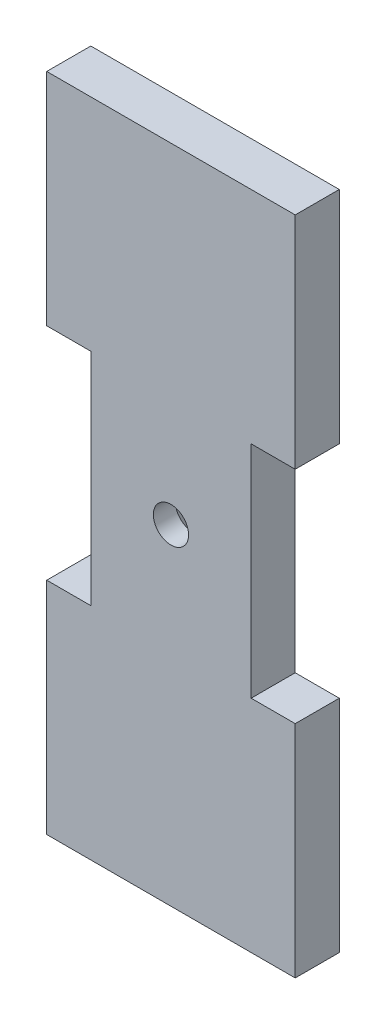
ISO-10303-21;
HEADER;
FILE_DESCRIPTION(('STEP AP214'),'2;1');
FILE_NAME('part.step','',(''),(''),'','','');
FILE_SCHEMA(('AUTOMOTIVE_DESIGN { 1 0 10303 214 1 1 1 1 }'));
ENDSEC;
DATA;
#1=APPLICATION_CONTEXT('core data for automotive mechanical design processes');
#2=APPLICATION_PROTOCOL_DEFINITION('international standard','automotive_design',2000,#1);
#3=PRODUCT_CONTEXT('',#1,'mechanical');
#4=PRODUCT('Part','Part','',(#3));
#5=PRODUCT_RELATED_PRODUCT_CATEGORY('part','',(#4));
#6=PRODUCT_DEFINITION_FORMATION('','',#4);
#7=PRODUCT_DEFINITION_CONTEXT('part definition',#1,'design');
#8=PRODUCT_DEFINITION('design','',#6,#7);
#9=PRODUCT_DEFINITION_SHAPE('','',#8);
#10=(LENGTH_UNIT() NAMED_UNIT(*) SI_UNIT(.MILLI.,.METRE.));
#11=(NAMED_UNIT(*) PLANE_ANGLE_UNIT() SI_UNIT($,.RADIAN.));
#12=(NAMED_UNIT(*) SI_UNIT($,.STERADIAN.) SOLID_ANGLE_UNIT());
#13=UNCERTAINTY_MEASURE_WITH_UNIT(LENGTH_MEASURE(1.E-05),#10,'distance_accuracy_value','');
#14=(GEOMETRIC_REPRESENTATION_CONTEXT(3) GLOBAL_UNCERTAINTY_ASSIGNED_CONTEXT((#13)) GLOBAL_UNIT_ASSIGNED_CONTEXT((#10,
#11,#12)) REPRESENTATION_CONTEXT('',''));
#15=CARTESIAN_POINT('',(0.,0.,0.));
#16=DIRECTION('',(0.,0.,1.));
#17=DIRECTION('',(1.,0.,0.));
#18=AXIS2_PLACEMENT_3D('',#15,#16,#17);
#19=CARTESIAN_POINT('',(0.,0.,10.));
#20=DIRECTION('',(0.,0.,-1.));
#21=DIRECTION('',(-1.,0.,0.));
#22=AXIS2_PLACEMENT_3D('',#19,#20,#21);
#23=PLANE('',#22);
#24=DIRECTION('',(0.,-1.,0.));
#25=VECTOR('',#24,1.);
#26=CARTESIAN_POINT('',(0.,50.,10.));
#27=LINE('',#26,#25);
#28=CARTESIAN_POINT('',(0.,50.,10.));
#29=VERTEX_POINT('',#28);
#30=CARTESIAN_POINT('',(0.,0.,10.));
#31=VERTEX_POINT('',#30);
#32=EDGE_CURVE('E178',#29,#31,#27,.T.);
#33=ORIENTED_EDGE('',*,*,#32,.T.);
#34=DIRECTION('',(1.,0.,0.));
#35=VECTOR('',#34,1.);
#36=CARTESIAN_POINT('',(56.4,0.,10.));
#37=LINE('',#36,#35);
#38=CARTESIAN_POINT('',(56.4,0.,10.));
#39=VERTEX_POINT('',#38);
#40=EDGE_CURVE('E106',#31,#39,#37,.T.);
#41=ORIENTED_EDGE('',*,*,#40,.T.);
#42=DIRECTION('',(0.,1.,0.));
#43=VECTOR('',#42,1.);
#44=CARTESIAN_POINT('',(56.4,50.,10.));
#45=LINE('',#44,#43);
#46=CARTESIAN_POINT('',(56.4,50.,10.));
#47=VERTEX_POINT('',#46);
#48=EDGE_CURVE('E275',#39,#47,#45,.T.);
#49=ORIENTED_EDGE('',*,*,#48,.T.);
#50=DIRECTION('',(-1.,0.,0.));
#51=VECTOR('',#50,1.);
#52=CARTESIAN_POINT('',(46.4,50.,10.));
#53=LINE('',#52,#51);
#54=CARTESIAN_POINT('',(46.4,50.,10.));
#55=VERTEX_POINT('',#54);
#56=EDGE_CURVE('E277',#47,#55,#53,.T.);
#57=ORIENTED_EDGE('',*,*,#56,.T.);
#58=DIRECTION('',(0.,1.,0.));
#59=VECTOR('',#58,1.);
#60=CARTESIAN_POINT('',(46.4,100.,10.));
#61=LINE('',#60,#59);
#62=CARTESIAN_POINT('',(46.4,100.,10.));
#63=VERTEX_POINT('',#62);
#64=EDGE_CURVE('E279',#55,#63,#61,.T.);
#65=ORIENTED_EDGE('',*,*,#64,.T.);
#66=DIRECTION('',(1.,0.,0.));
#67=VECTOR('',#66,1.);
#68=CARTESIAN_POINT('',(56.4,100.,10.));
#69=LINE('',#68,#67);
#70=CARTESIAN_POINT('',(56.4,100.,10.));
#71=VERTEX_POINT('',#70);
#72=EDGE_CURVE('E285',#63,#71,#69,.T.);
#73=ORIENTED_EDGE('',*,*,#72,.T.);
#74=DIRECTION('',(0.,1.,0.));
#75=VECTOR('',#74,1.);
#76=CARTESIAN_POINT('',(56.4,150.,10.));
#77=LINE('',#76,#75);
#78=CARTESIAN_POINT('',(56.4,150.,10.));
#79=VERTEX_POINT('',#78);
#80=EDGE_CURVE('E287',#71,#79,#77,.T.);
#81=ORIENTED_EDGE('',*,*,#80,.T.);
#82=DIRECTION('',(-1.,0.,0.));
#83=VECTOR('',#82,1.);
#84=CARTESIAN_POINT('',(0.,150.,10.));
#85=LINE('',#84,#83);
#86=CARTESIAN_POINT('',(0.,150.,10.));
#87=VERTEX_POINT('',#86);
#88=EDGE_CURVE('E289',#79,#87,#85,.T.);
#89=ORIENTED_EDGE('',*,*,#88,.T.);
#90=DIRECTION('',(0.,-1.,0.));
#91=VECTOR('',#90,1.);
#92=CARTESIAN_POINT('',(0.,150.,10.));
#93=LINE('',#92,#91);
#94=CARTESIAN_POINT('',(0.,100.,10.));
#95=VERTEX_POINT('',#94);
#96=EDGE_CURVE('E137',#87,#95,#93,.T.);
#97=ORIENTED_EDGE('',*,*,#96,.T.);
#98=DIRECTION('',(1.,0.,0.));
#99=VECTOR('',#98,1.);
#100=CARTESIAN_POINT('',(0.,100.,10.));
#101=LINE('',#100,#99);
#102=CARTESIAN_POINT('',(9.99999999999997,100.,10.));
#103=VERTEX_POINT('',#102);
#104=EDGE_CURVE('E131',#95,#103,#101,.T.);
#105=ORIENTED_EDGE('',*,*,#104,.T.);
#106=DIRECTION('',(0.,-1.,0.));
#107=VECTOR('',#106,1.);
#108=CARTESIAN_POINT('',(9.99999999999997,100.,10.));
#109=LINE('',#108,#107);
#110=CARTESIAN_POINT('',(9.99999999999996,50.,10.));
#111=VERTEX_POINT('',#110);
#112=EDGE_CURVE('E135',#103,#111,#109,.T.);
#113=ORIENTED_EDGE('',*,*,#112,.T.);
#114=DIRECTION('',(-1.,0.,0.));
#115=VECTOR('',#114,1.);
#116=CARTESIAN_POINT('',(9.99999999999996,50.,10.));
#117=LINE('',#116,#115);
#118=EDGE_CURVE('E50',#111,#29,#117,.T.);
#119=ORIENTED_EDGE('',*,*,#118,.T.);
#120=EDGE_LOOP('',(#33,#41,#49,#57,#65,#73,#81,#89,#97,#105,#113,#119));
#121=FACE_BOUND('',#120,.T.);
#122=CARTESIAN_POINT('',(28.2,75.,10.));
#123=DIRECTION('',(0.,0.,1.));
#124=DIRECTION('',(1.,0.,0.));
#125=AXIS2_PLACEMENT_3D('',#122,#123,#124);
#126=CIRCLE('',#125,4.);
#127=CARTESIAN_POINT('',(32.2,75.,10.));
#128=VERTEX_POINT('',#127);
#129=EDGE_CURVE('E159',#128,#128,#126,.T.);
#130=ORIENTED_EDGE('',*,*,#129,.F.);
#131=EDGE_LOOP('',(#130));
#132=FACE_BOUND('',#131,.T.);
#133=ADVANCED_FACE('F33',(#121,#132),#23,.F.);
#134=CARTESIAN_POINT('',(0.,0.,0.));
#135=DIRECTION('',(0.,0.,-1.));
#136=DIRECTION('',(-1.,0.,0.));
#137=AXIS2_PLACEMENT_3D('',#134,#135,#136);
#138=PLANE('',#137);
#139=CARTESIAN_POINT('',(28.2,75.,0.));
#140=DIRECTION('',(0.,0.,-1.));
#141=DIRECTION('',(-1.,0.,0.));
#142=AXIS2_PLACEMENT_3D('',#139,#140,#141);
#143=CIRCLE('',#142,8.99999999999999);
#144=CARTESIAN_POINT('',(19.2,75.,0.));
#145=VERTEX_POINT('',#144);
#146=EDGE_CURVE('E42',#145,#145,#143,.F.);
#147=ORIENTED_EDGE('',*,*,#146,.T.);
#148=EDGE_LOOP('',(#147));
#149=FACE_BOUND('',#148,.T.);
#150=DIRECTION('',(0.,-1.,0.));
#151=VECTOR('',#150,1.);
#152=CARTESIAN_POINT('',(0.,50.,0.));
#153=LINE('',#152,#151);
#154=CARTESIAN_POINT('',(0.,50.,0.));
#155=VERTEX_POINT('',#154);
#156=CARTESIAN_POINT('',(0.,0.,0.));
#157=VERTEX_POINT('',#156);
#158=EDGE_CURVE('E155',#155,#157,#153,.T.);
#159=ORIENTED_EDGE('',*,*,#158,.F.);
#160=DIRECTION('',(-1.,0.,0.));
#161=VECTOR('',#160,1.);
#162=CARTESIAN_POINT('',(9.99999999999996,50.,0.));
#163=LINE('',#162,#161);
#164=CARTESIAN_POINT('',(9.99999999999996,50.,0.));
#165=VERTEX_POINT('',#164);
#166=EDGE_CURVE('E97',#165,#155,#163,.T.);
#167=ORIENTED_EDGE('',*,*,#166,.F.);
#168=DIRECTION('',(0.,-1.,0.));
#169=VECTOR('',#168,1.);
#170=CARTESIAN_POINT('',(9.99999999999997,100.,0.));
#171=LINE('',#170,#169);
#172=CARTESIAN_POINT('',(9.99999999999997,100.,0.));
#173=VERTEX_POINT('',#172);
#174=EDGE_CURVE('E91',#173,#165,#171,.T.);
#175=ORIENTED_EDGE('',*,*,#174,.F.);
#176=DIRECTION('',(1.,0.,0.));
#177=VECTOR('',#176,1.);
#178=CARTESIAN_POINT('',(0.,100.,0.));
#179=LINE('',#178,#177);
#180=CARTESIAN_POINT('',(0.,100.,0.));
#181=VERTEX_POINT('',#180);
#182=EDGE_CURVE('E145',#181,#173,#179,.T.);
#183=ORIENTED_EDGE('',*,*,#182,.F.);
#184=DIRECTION('',(0.,-1.,0.));
#185=VECTOR('',#184,1.);
#186=CARTESIAN_POINT('',(0.,150.,0.));
#187=LINE('',#186,#185);
#188=CARTESIAN_POINT('',(0.,150.,0.));
#189=VERTEX_POINT('',#188);
#190=EDGE_CURVE('E173',#189,#181,#187,.T.);
#191=ORIENTED_EDGE('',*,*,#190,.F.);
#192=DIRECTION('',(-1.,0.,0.));
#193=VECTOR('',#192,1.);
#194=CARTESIAN_POINT('',(0.,150.,0.));
#195=LINE('',#194,#193);
#196=CARTESIAN_POINT('',(56.4,150.,0.));
#197=VERTEX_POINT('',#196);
#198=EDGE_CURVE('E171',#197,#189,#195,.T.);
#199=ORIENTED_EDGE('',*,*,#198,.F.);
#200=DIRECTION('',(0.,1.,0.));
#201=VECTOR('',#200,1.);
#202=CARTESIAN_POINT('',(56.4,150.,0.));
#203=LINE('',#202,#201);
#204=CARTESIAN_POINT('',(56.4,100.,0.));
#205=VERTEX_POINT('',#204);
#206=EDGE_CURVE('E169',#205,#197,#203,.T.);
#207=ORIENTED_EDGE('',*,*,#206,.F.);
#208=DIRECTION('',(1.,0.,0.));
#209=VECTOR('',#208,1.);
#210=CARTESIAN_POINT('',(56.4,100.,0.));
#211=LINE('',#210,#209);
#212=CARTESIAN_POINT('',(46.4,100.,0.));
#213=VERTEX_POINT('',#212);
#214=EDGE_CURVE('E167',#213,#205,#211,.T.);
#215=ORIENTED_EDGE('',*,*,#214,.F.);
#216=DIRECTION('',(0.,1.,0.));
#217=VECTOR('',#216,1.);
#218=CARTESIAN_POINT('',(46.4,100.,0.));
#219=LINE('',#218,#217);
#220=CARTESIAN_POINT('',(46.4,50.,0.));
#221=VERTEX_POINT('',#220);
#222=EDGE_CURVE('E165',#221,#213,#219,.T.);
#223=ORIENTED_EDGE('',*,*,#222,.F.);
#224=DIRECTION('',(-1.,0.,0.));
#225=VECTOR('',#224,1.);
#226=CARTESIAN_POINT('',(46.4,50.,0.));
#227=LINE('',#226,#225);
#228=CARTESIAN_POINT('',(56.4,50.,0.));
#229=VERTEX_POINT('',#228);
#230=EDGE_CURVE('E163',#229,#221,#227,.T.);
#231=ORIENTED_EDGE('',*,*,#230,.F.);
#232=DIRECTION('',(0.,1.,0.));
#233=VECTOR('',#232,1.);
#234=CARTESIAN_POINT('',(56.4,50.,0.));
#235=LINE('',#234,#233);
#236=CARTESIAN_POINT('',(56.4,0.,0.));
#237=VERTEX_POINT('',#236);
#238=EDGE_CURVE('E161',#237,#229,#235,.T.);
#239=ORIENTED_EDGE('',*,*,#238,.F.);
#240=DIRECTION('',(1.,0.,0.));
#241=VECTOR('',#240,1.);
#242=CARTESIAN_POINT('',(56.4,0.,0.));
#243=LINE('',#242,#241);
#244=EDGE_CURVE('E158',#157,#237,#243,.T.);
#245=ORIENTED_EDGE('',*,*,#244,.F.);
#246=EDGE_LOOP('',(#159,#167,#175,#183,#191,#199,#207,#215,#223,#231,#239,#245));
#247=FACE_BOUND('',#246,.T.);
#248=ADVANCED_FACE('F207',(#149,#247),#138,.T.);
#249=CARTESIAN_POINT('',(0.,50.,10.));
#250=DIRECTION('',(1.,0.,0.));
#251=DIRECTION('',(0.,1.,0.));
#252=AXIS2_PLACEMENT_3D('',#249,#250,#251);
#253=PLANE('',#252);
#254=ORIENTED_EDGE('',*,*,#158,.T.);
#255=DIRECTION('',(0.,0.,-1.));
#256=VECTOR('',#255,1.);
#257=CARTESIAN_POINT('',(0.,0.,10.));
#258=LINE('',#257,#256);
#259=EDGE_CURVE('E203',#31,#157,#258,.T.);
#260=ORIENTED_EDGE('',*,*,#259,.F.);
#261=ORIENTED_EDGE('',*,*,#32,.F.);
#262=DIRECTION('',(0.,0.,-1.));
#263=VECTOR('',#262,1.);
#264=CARTESIAN_POINT('',(0.,50.,10.));
#265=LINE('',#264,#263);
#266=EDGE_CURVE('E151',#29,#155,#265,.T.);
#267=ORIENTED_EDGE('',*,*,#266,.T.);
#268=EDGE_LOOP('',(#254,#260,#261,#267));
#269=FACE_BOUND('',#268,.T.);
#270=ADVANCED_FACE('F225',(#269),#253,.F.);
#271=CARTESIAN_POINT('',(56.4,0.,10.));
#272=DIRECTION('',(0.,1.,0.));
#273=DIRECTION('',(-1.,0.,0.));
#274=AXIS2_PLACEMENT_3D('',#271,#272,#273);
#275=PLANE('',#274);
#276=ORIENTED_EDGE('',*,*,#244,.T.);
#277=DIRECTION('',(0.,0.,-1.));
#278=VECTOR('',#277,1.);
#279=CARTESIAN_POINT('',(56.4,0.,10.));
#280=LINE('',#279,#278);
#281=EDGE_CURVE('E200',#39,#237,#280,.T.);
#282=ORIENTED_EDGE('',*,*,#281,.F.);
#283=ORIENTED_EDGE('',*,*,#40,.F.);
#284=ORIENTED_EDGE('',*,*,#259,.T.);
#285=EDGE_LOOP('',(#276,#282,#283,#284));
#286=FACE_BOUND('',#285,.T.);
#287=ADVANCED_FACE('F261',(#286),#275,.F.);
#288=CARTESIAN_POINT('',(56.4,50.,10.));
#289=DIRECTION('',(-1.,0.,0.));
#290=DIRECTION('',(0.,-1.,0.));
#291=AXIS2_PLACEMENT_3D('',#288,#289,#290);
#292=PLANE('',#291);
#293=ORIENTED_EDGE('',*,*,#238,.T.);
#294=DIRECTION('',(0.,0.,-1.));
#295=VECTOR('',#294,1.);
#296=CARTESIAN_POINT('',(56.4,50.,10.));
#297=LINE('',#296,#295);
#298=EDGE_CURVE('E197',#47,#229,#297,.T.);
#299=ORIENTED_EDGE('',*,*,#298,.F.);
#300=ORIENTED_EDGE('',*,*,#48,.F.);
#301=ORIENTED_EDGE('',*,*,#281,.T.);
#302=EDGE_LOOP('',(#293,#299,#300,#301));
#303=FACE_BOUND('',#302,.T.);
#304=ADVANCED_FACE('F257',(#303),#292,.F.);
#305=CARTESIAN_POINT('',(46.4,50.,10.));
#306=DIRECTION('',(0.,-1.,0.));
#307=DIRECTION('',(1.,0.,0.));
#308=AXIS2_PLACEMENT_3D('',#305,#306,#307);
#309=PLANE('',#308);
#310=ORIENTED_EDGE('',*,*,#230,.T.);
#311=DIRECTION('',(0.,0.,-1.));
#312=VECTOR('',#311,1.);
#313=CARTESIAN_POINT('',(46.4,50.,10.));
#314=LINE('',#313,#312);
#315=EDGE_CURVE('E194',#55,#221,#314,.T.);
#316=ORIENTED_EDGE('',*,*,#315,.F.);
#317=ORIENTED_EDGE('',*,*,#56,.F.);
#318=ORIENTED_EDGE('',*,*,#298,.T.);
#319=EDGE_LOOP('',(#310,#316,#317,#318));
#320=FACE_BOUND('',#319,.T.);
#321=ADVANCED_FACE('F253',(#320),#309,.F.);
#322=CARTESIAN_POINT('',(46.4,100.,10.));
#323=DIRECTION('',(-1.,0.,0.));
#324=DIRECTION('',(0.,-1.,0.));
#325=AXIS2_PLACEMENT_3D('',#322,#323,#324);
#326=PLANE('',#325);
#327=ORIENTED_EDGE('',*,*,#222,.T.);
#328=DIRECTION('',(0.,0.,-1.));
#329=VECTOR('',#328,1.);
#330=CARTESIAN_POINT('',(46.4,100.,10.));
#331=LINE('',#330,#329);
#332=EDGE_CURVE('E191',#63,#213,#331,.T.);
#333=ORIENTED_EDGE('',*,*,#332,.F.);
#334=ORIENTED_EDGE('',*,*,#64,.F.);
#335=ORIENTED_EDGE('',*,*,#315,.T.);
#336=EDGE_LOOP('',(#327,#333,#334,#335));
#337=FACE_BOUND('',#336,.T.);
#338=ADVANCED_FACE('F249',(#337),#326,.F.);
#339=CARTESIAN_POINT('',(56.4,100.,10.));
#340=DIRECTION('',(0.,1.,0.));
#341=DIRECTION('',(0.,0.,1.));
#342=AXIS2_PLACEMENT_3D('',#339,#340,#341);
#343=PLANE('',#342);
#344=ORIENTED_EDGE('',*,*,#214,.T.);
#345=DIRECTION('',(0.,0.,-1.));
#346=VECTOR('',#345,1.);
#347=CARTESIAN_POINT('',(56.4,100.,10.));
#348=LINE('',#347,#346);
#349=EDGE_CURVE('E188',#71,#205,#348,.T.);
#350=ORIENTED_EDGE('',*,*,#349,.F.);
#351=ORIENTED_EDGE('',*,*,#72,.F.);
#352=ORIENTED_EDGE('',*,*,#332,.T.);
#353=EDGE_LOOP('',(#344,#350,#351,#352));
#354=FACE_BOUND('',#353,.T.);
#355=ADVANCED_FACE('F245',(#354),#343,.F.);
#356=CARTESIAN_POINT('',(56.4,150.,10.));
#357=DIRECTION('',(-1.,0.,0.));
#358=DIRECTION('',(0.,-1.,0.));
#359=AXIS2_PLACEMENT_3D('',#356,#357,#358);
#360=PLANE('',#359);
#361=ORIENTED_EDGE('',*,*,#206,.T.);
#362=DIRECTION('',(0.,0.,-1.));
#363=VECTOR('',#362,1.);
#364=CARTESIAN_POINT('',(56.4,150.,10.));
#365=LINE('',#364,#363);
#366=EDGE_CURVE('E185',#79,#197,#365,.T.);
#367=ORIENTED_EDGE('',*,*,#366,.F.);
#368=ORIENTED_EDGE('',*,*,#80,.F.);
#369=ORIENTED_EDGE('',*,*,#349,.T.);
#370=EDGE_LOOP('',(#361,#367,#368,#369));
#371=FACE_BOUND('',#370,.T.);
#372=ADVANCED_FACE('F241',(#371),#360,.F.);
#373=CARTESIAN_POINT('',(0.,150.,10.));
#374=DIRECTION('',(0.,-1.,0.));
#375=DIRECTION('',(0.,0.,-1.));
#376=AXIS2_PLACEMENT_3D('',#373,#374,#375);
#377=PLANE('',#376);
#378=ORIENTED_EDGE('',*,*,#198,.T.);
#379=DIRECTION('',(0.,0.,-1.));
#380=VECTOR('',#379,1.);
#381=CARTESIAN_POINT('',(0.,150.,10.));
#382=LINE('',#381,#380);
#383=EDGE_CURVE('E182',#87,#189,#382,.T.);
#384=ORIENTED_EDGE('',*,*,#383,.F.);
#385=ORIENTED_EDGE('',*,*,#88,.F.);
#386=ORIENTED_EDGE('',*,*,#366,.T.);
#387=EDGE_LOOP('',(#378,#384,#385,#386));
#388=FACE_BOUND('',#387,.T.);
#389=ADVANCED_FACE('F237',(#388),#377,.F.);
#390=CARTESIAN_POINT('',(0.,150.,10.));
#391=DIRECTION('',(1.,0.,0.));
#392=DIRECTION('',(0.,1.,0.));
#393=AXIS2_PLACEMENT_3D('',#390,#391,#392);
#394=PLANE('',#393);
#395=ORIENTED_EDGE('',*,*,#190,.T.);
#396=DIRECTION('',(0.,0.,-1.));
#397=VECTOR('',#396,1.);
#398=CARTESIAN_POINT('',(0.,100.,10.));
#399=LINE('',#398,#397);
#400=EDGE_CURVE('E146',#95,#181,#399,.T.);
#401=ORIENTED_EDGE('',*,*,#400,.F.);
#402=ORIENTED_EDGE('',*,*,#96,.F.);
#403=ORIENTED_EDGE('',*,*,#383,.T.);
#404=EDGE_LOOP('',(#395,#401,#402,#403));
#405=FACE_BOUND('',#404,.T.);
#406=ADVANCED_FACE('F234',(#405),#394,.F.);
#407=CARTESIAN_POINT('',(0.,100.,10.));
#408=DIRECTION('',(0.,1.,0.));
#409=DIRECTION('',(0.,0.,1.));
#410=AXIS2_PLACEMENT_3D('',#407,#408,#409);
#411=PLANE('',#410);
#412=ORIENTED_EDGE('',*,*,#182,.T.);
#413=DIRECTION('',(0.,0.,-1.));
#414=VECTOR('',#413,1.);
#415=CARTESIAN_POINT('',(9.99999999999997,100.,10.));
#416=LINE('',#415,#414);
#417=EDGE_CURVE('E142',#103,#173,#416,.T.);
#418=ORIENTED_EDGE('',*,*,#417,.F.);
#419=ORIENTED_EDGE('',*,*,#104,.F.);
#420=ORIENTED_EDGE('',*,*,#400,.T.);
#421=EDGE_LOOP('',(#412,#418,#419,#420));
#422=FACE_BOUND('',#421,.T.);
#423=ADVANCED_FACE('F143',(#422),#411,.F.);
#424=CARTESIAN_POINT('',(9.99999999999997,100.,10.));
#425=DIRECTION('',(1.,0.,0.));
#426=DIRECTION('',(0.,1.,0.));
#427=AXIS2_PLACEMENT_3D('',#424,#425,#426);
#428=PLANE('',#427);
#429=ORIENTED_EDGE('',*,*,#174,.T.);
#430=DIRECTION('',(0.,0.,-1.));
#431=VECTOR('',#430,1.);
#432=CARTESIAN_POINT('',(9.99999999999996,50.,10.));
#433=LINE('',#432,#431);
#434=EDGE_CURVE('E147',#111,#165,#433,.T.);
#435=ORIENTED_EDGE('',*,*,#434,.F.);
#436=ORIENTED_EDGE('',*,*,#112,.F.);
#437=ORIENTED_EDGE('',*,*,#417,.T.);
#438=EDGE_LOOP('',(#429,#435,#436,#437));
#439=FACE_BOUND('',#438,.T.);
#440=ADVANCED_FACE('F149',(#439),#428,.F.);
#441=CARTESIAN_POINT('',(9.99999999999996,50.,10.));
#442=DIRECTION('',(0.,-1.,0.));
#443=DIRECTION('',(0.,0.,-1.));
#444=AXIS2_PLACEMENT_3D('',#441,#442,#443);
#445=PLANE('',#444);
#446=ORIENTED_EDGE('',*,*,#166,.T.);
#447=ORIENTED_EDGE('',*,*,#266,.F.);
#448=ORIENTED_EDGE('',*,*,#118,.F.);
#449=ORIENTED_EDGE('',*,*,#434,.T.);
#450=EDGE_LOOP('',(#446,#447,#448,#449));
#451=FACE_BOUND('',#450,.T.);
#452=ADVANCED_FACE('F216',(#451),#445,.F.);
#453=CARTESIAN_POINT('',(28.2,75.,10.));
#454=DIRECTION('',(0.,0.,-1.));
#455=DIRECTION('',(-1.,0.,0.));
#456=AXIS2_PLACEMENT_3D('',#453,#454,#455);
#457=CYLINDRICAL_SURFACE('',#456,4.);
#458=CARTESIAN_POINT('',(28.2,75.,5.00000000000001));
#459=DIRECTION('',(0.,0.,-1.));
#460=DIRECTION('',(-1.,0.,0.));
#461=AXIS2_PLACEMENT_3D('',#458,#459,#460);
#462=CIRCLE('',#461,4.);
#463=CARTESIAN_POINT('',(24.2,75.,5.00000000000001));
#464=VERTEX_POINT('',#463);
#465=EDGE_CURVE('E11',#464,#464,#462,.T.);
#466=ORIENTED_EDGE('',*,*,#465,.T.);
#467=EDGE_LOOP('',(#466));
#468=FACE_BOUND('',#467,.T.);
#469=ORIENTED_EDGE('',*,*,#129,.T.);
#470=EDGE_LOOP('',(#469));
#471=FACE_BOUND('',#470,.T.);
#472=ADVANCED_FACE('F211',(#468,#471),#457,.F.);
#473=CARTESIAN_POINT('',(28.2,75.,0.));
#474=DIRECTION('',(0.,0.,-1.));
#475=DIRECTION('',(-1.,0.,0.));
#476=AXIS2_PLACEMENT_3D('',#473,#474,#475);
#477=CONICAL_SURFACE('',#476,8.99999999999999,0.785398163397447);
#478=ORIENTED_EDGE('',*,*,#465,.F.);
#479=EDGE_LOOP('',(#478));
#480=FACE_BOUND('',#479,.T.);
#481=ORIENTED_EDGE('',*,*,#146,.F.);
#482=EDGE_LOOP('',(#481));
#483=FACE_BOUND('',#482,.T.);
#484=ADVANCED_FACE('F35',(#480,#483),#477,.F.);
#485=CLOSED_SHELL('',(#133,#248,#270,#287,#304,#321,#338,#355,#372,#389,#406,#423,#440,#452,
#472,#484));
#486=MANIFOLD_SOLID_BREP('B2',#485);
#487=ADVANCED_BREP_SHAPE_REPRESENTATION('',(#18,#486),#14);
#488=SHAPE_DEFINITION_REPRESENTATION(#9,#487);
ENDSEC;
END-ISO-10303-21;
